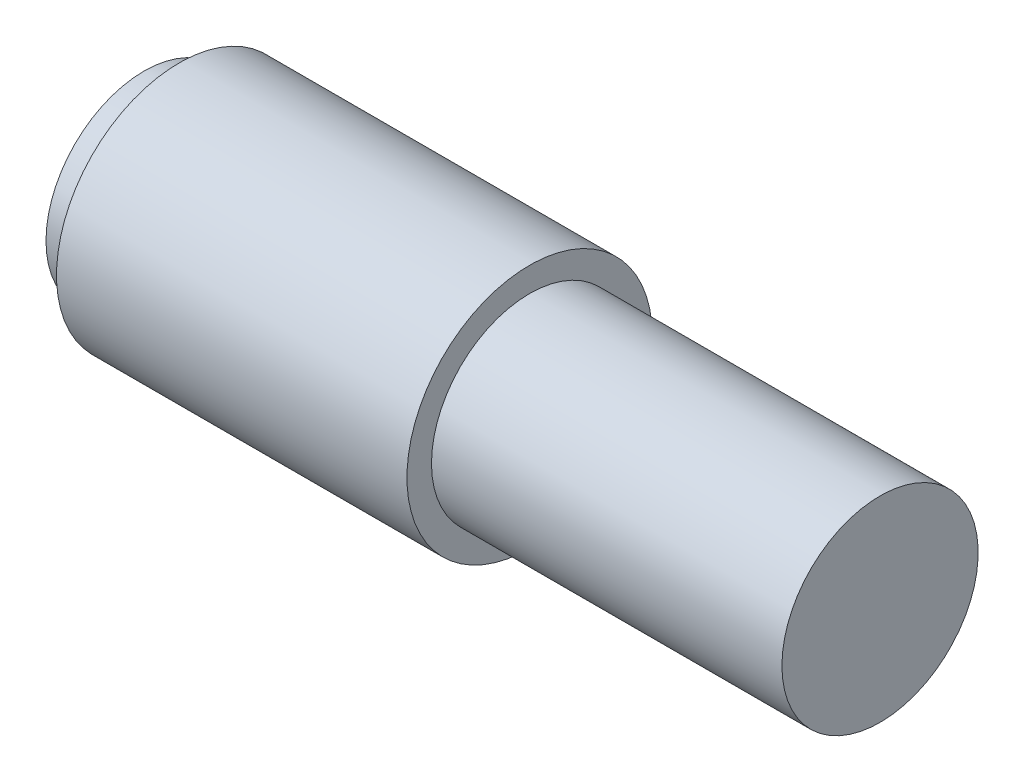
ISO-10303-21;
HEADER;
FILE_DESCRIPTION(('STEP AP214'),'2;1');
FILE_NAME('part.step','',(''),(''),'','','');
FILE_SCHEMA(('AUTOMOTIVE_DESIGN { 1 0 10303 214 1 1 1 1 }'));
ENDSEC;
DATA;
#1=APPLICATION_CONTEXT('core data for automotive mechanical design processes');
#2=APPLICATION_PROTOCOL_DEFINITION('international standard','automotive_design',2000,#1);
#3=PRODUCT_CONTEXT('',#1,'mechanical');
#4=PRODUCT('Part','Part','',(#3));
#5=PRODUCT_RELATED_PRODUCT_CATEGORY('part','',(#4));
#6=PRODUCT_DEFINITION_FORMATION('','',#4);
#7=PRODUCT_DEFINITION_CONTEXT('part definition',#1,'design');
#8=PRODUCT_DEFINITION('design','',#6,#7);
#9=PRODUCT_DEFINITION_SHAPE('','',#8);
#10=(LENGTH_UNIT() NAMED_UNIT(*) SI_UNIT(.MILLI.,.METRE.));
#11=(NAMED_UNIT(*) PLANE_ANGLE_UNIT() SI_UNIT($,.RADIAN.));
#12=(NAMED_UNIT(*) SI_UNIT($,.STERADIAN.) SOLID_ANGLE_UNIT());
#13=UNCERTAINTY_MEASURE_WITH_UNIT(LENGTH_MEASURE(1.E-05),#10,'distance_accuracy_value','');
#14=(GEOMETRIC_REPRESENTATION_CONTEXT(3) GLOBAL_UNCERTAINTY_ASSIGNED_CONTEXT((#13)) GLOBAL_UNIT_ASSIGNED_CONTEXT((#10,
#11,#12)) REPRESENTATION_CONTEXT('',''));
#15=CARTESIAN_POINT('',(0.,0.,0.));
#16=DIRECTION('',(0.,0.,1.));
#17=DIRECTION('',(1.,0.,0.));
#18=AXIS2_PLACEMENT_3D('',#15,#16,#17);
#19=CARTESIAN_POINT('',(0.,0.,0.));
#20=DIRECTION('',(1.,0.,0.));
#21=DIRECTION('',(0.,0.,-1.));
#22=AXIS2_PLACEMENT_3D('',#19,#20,#21);
#23=PLANE('',#22);
#24=CARTESIAN_POINT('',(0.,0.,0.));
#25=DIRECTION('',(1.,0.,0.));
#26=DIRECTION('',(0.,0.,-1.));
#27=AXIS2_PLACEMENT_3D('',#24,#25,#26);
#28=CIRCLE('',#27,1.75);
#29=CARTESIAN_POINT('',(0.,0.,-1.75));
#30=VERTEX_POINT('',#29);
#31=EDGE_CURVE('E47',#30,#30,#28,.T.);
#32=ORIENTED_EDGE('',*,*,#31,.F.);
#33=EDGE_LOOP('',(#32));
#34=FACE_BOUND('',#33,.T.);
#35=CARTESIAN_POINT('',(0.,0.,0.));
#36=DIRECTION('',(1.,0.,0.));
#37=DIRECTION('',(0.,0.,-1.));
#38=AXIS2_PLACEMENT_3D('',#35,#36,#37);
#39=CIRCLE('',#38,1.4);
#40=CARTESIAN_POINT('',(0.,0.,-1.4));
#41=VERTEX_POINT('',#40);
#42=EDGE_CURVE('E10',#41,#41,#39,.F.);
#43=ORIENTED_EDGE('',*,*,#42,.F.);
#44=EDGE_LOOP('',(#43));
#45=FACE_BOUND('',#44,.T.);
#46=ADVANCED_FACE('F31',(#34,#45),#23,.F.);
#47=CARTESIAN_POINT('',(5.,0.,0.));
#48=DIRECTION('',(-1.,0.,0.));
#49=DIRECTION('',(0.,0.,1.));
#50=AXIS2_PLACEMENT_3D('',#47,#48,#49);
#51=CYLINDRICAL_SURFACE('',#50,1.75);
#52=CARTESIAN_POINT('',(5.,0.,0.));
#53=DIRECTION('',(1.,0.,0.));
#54=DIRECTION('',(0.,0.,-1.));
#55=AXIS2_PLACEMENT_3D('',#52,#53,#54);
#56=CIRCLE('',#55,1.75);
#57=CARTESIAN_POINT('',(5.,0.,-1.75));
#58=VERTEX_POINT('',#57);
#59=EDGE_CURVE('E42',#58,#58,#56,.T.);
#60=ORIENTED_EDGE('',*,*,#59,.F.);
#61=EDGE_LOOP('',(#60));
#62=FACE_BOUND('',#61,.T.);
#63=ORIENTED_EDGE('',*,*,#31,.T.);
#64=EDGE_LOOP('',(#63));
#65=FACE_BOUND('',#64,.T.);
#66=ADVANCED_FACE('F33',(#62,#65),#51,.T.);
#67=CARTESIAN_POINT('',(5.,0.,0.));
#68=DIRECTION('',(1.,0.,0.));
#69=DIRECTION('',(0.,0.,-1.));
#70=AXIS2_PLACEMENT_3D('',#67,#68,#69);
#71=PLANE('',#70);
#72=CARTESIAN_POINT('',(5.,0.,0.));
#73=DIRECTION('',(1.,0.,0.));
#74=DIRECTION('',(0.,0.,-1.));
#75=AXIS2_PLACEMENT_3D('',#72,#73,#74);
#76=CIRCLE('',#75,1.4);
#77=CARTESIAN_POINT('',(5.,0.,-1.4));
#78=VERTEX_POINT('',#77);
#79=EDGE_CURVE('E38',#78,#78,#76,.T.);
#80=ORIENTED_EDGE('',*,*,#79,.F.);
#81=EDGE_LOOP('',(#80));
#82=FACE_BOUND('',#81,.T.);
#83=ORIENTED_EDGE('',*,*,#59,.T.);
#84=EDGE_LOOP('',(#83));
#85=FACE_BOUND('',#84,.T.);
#86=ADVANCED_FACE('F81',(#82,#85),#71,.T.);
#87=CARTESIAN_POINT('',(10.,0.,0.));
#88=DIRECTION('',(-1.,0.,0.));
#89=DIRECTION('',(0.,0.,1.));
#90=AXIS2_PLACEMENT_3D('',#87,#88,#89);
#91=CYLINDRICAL_SURFACE('',#90,1.4);
#92=ORIENTED_EDGE('',*,*,#79,.T.);
#93=EDGE_LOOP('',(#92));
#94=FACE_BOUND('',#93,.T.);
#95=CARTESIAN_POINT('',(10.,0.,0.));
#96=DIRECTION('',(-1.,0.,0.));
#97=DIRECTION('',(0.,0.,1.));
#98=AXIS2_PLACEMENT_3D('',#95,#96,#97);
#99=CIRCLE('',#98,1.4);
#100=CARTESIAN_POINT('',(10.,0.,1.4));
#101=VERTEX_POINT('',#100);
#102=EDGE_CURVE('E50',#101,#101,#99,.T.);
#103=ORIENTED_EDGE('',*,*,#102,.T.);
#104=EDGE_LOOP('',(#103));
#105=FACE_BOUND('',#104,.T.);
#106=ADVANCED_FACE('F73',(#94,#105),#91,.T.);
#107=CARTESIAN_POINT('',(10.,0.,0.));
#108=DIRECTION('',(-1.,0.,0.));
#109=DIRECTION('',(0.,0.,1.));
#110=AXIS2_PLACEMENT_3D('',#107,#108,#109);
#111=PLANE('',#110);
#112=ORIENTED_EDGE('',*,*,#102,.F.);
#113=EDGE_LOOP('',(#112));
#114=FACE_BOUND('',#113,.T.);
#115=ADVANCED_FACE('F66',(#114),#111,.F.);
#116=CARTESIAN_POINT('',(-0.5,0.,0.));
#117=DIRECTION('',(1.,0.,0.));
#118=DIRECTION('',(0.,0.,-1.));
#119=AXIS2_PLACEMENT_3D('',#116,#117,#118);
#120=CYLINDRICAL_SURFACE('',#119,1.4);
#121=CARTESIAN_POINT('',(-0.5,0.,0.));
#122=DIRECTION('',(-1.,0.,0.));
#123=DIRECTION('',(0.,0.,1.));
#124=AXIS2_PLACEMENT_3D('',#121,#122,#123);
#125=CIRCLE('',#124,1.4);
#126=CARTESIAN_POINT('',(-0.5,0.,1.4));
#127=VERTEX_POINT('',#126);
#128=EDGE_CURVE('E56',#127,#127,#125,.T.);
#129=ORIENTED_EDGE('',*,*,#128,.F.);
#130=EDGE_LOOP('',(#129));
#131=FACE_BOUND('',#130,.T.);
#132=ORIENTED_EDGE('',*,*,#42,.T.);
#133=EDGE_LOOP('',(#132));
#134=FACE_BOUND('',#133,.T.);
#135=ADVANCED_FACE('F64',(#131,#134),#120,.T.);
#136=CARTESIAN_POINT('',(-0.5,0.,0.));
#137=DIRECTION('',(-1.,0.,0.));
#138=DIRECTION('',(0.,0.,1.));
#139=AXIS2_PLACEMENT_3D('',#136,#137,#138);
#140=PLANE('',#139);
#141=ORIENTED_EDGE('',*,*,#128,.T.);
#142=EDGE_LOOP('',(#141));
#143=FACE_BOUND('',#142,.T.);
#144=ADVANCED_FACE('F62',(#143),#140,.T.);
#145=CLOSED_SHELL('',(#46,#66,#86,#106,#115,#135,#144));
#146=MANIFOLD_SOLID_BREP('B2',#145);
#147=ADVANCED_BREP_SHAPE_REPRESENTATION('',(#18,#146),#14);
#148=SHAPE_DEFINITION_REPRESENTATION(#9,#147);
ENDSEC;
END-ISO-10303-21;
